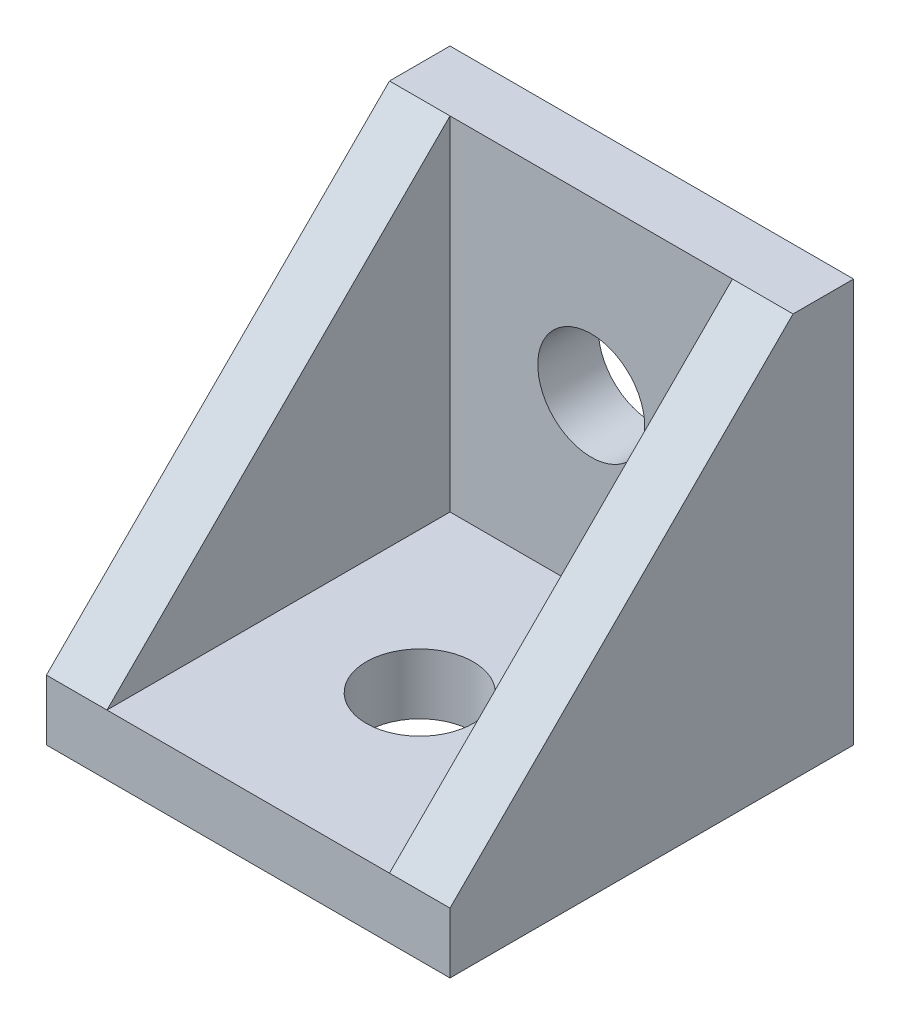
ISO-10303-21;
HEADER;
FILE_DESCRIPTION(('STEP AP214'),'2;1');
FILE_NAME('part.step','',(''),(''),'','','');
FILE_SCHEMA(('AUTOMOTIVE_DESIGN { 1 0 10303 214 1 1 1 1 }'));
ENDSEC;
DATA;
#1=APPLICATION_CONTEXT('core data for automotive mechanical design processes');
#2=APPLICATION_PROTOCOL_DEFINITION('international standard','automotive_design',2000,#1);
#3=PRODUCT_CONTEXT('',#1,'mechanical');
#4=PRODUCT('Part','Part','',(#3));
#5=PRODUCT_RELATED_PRODUCT_CATEGORY('part','',(#4));
#6=PRODUCT_DEFINITION_FORMATION('','',#4);
#7=PRODUCT_DEFINITION_CONTEXT('part definition',#1,'design');
#8=PRODUCT_DEFINITION('design','',#6,#7);
#9=PRODUCT_DEFINITION_SHAPE('','',#8);
#10=(LENGTH_UNIT() NAMED_UNIT(*) SI_UNIT(.MILLI.,.METRE.));
#11=(NAMED_UNIT(*) PLANE_ANGLE_UNIT() SI_UNIT($,.RADIAN.));
#12=(NAMED_UNIT(*) SI_UNIT($,.STERADIAN.) SOLID_ANGLE_UNIT());
#13=UNCERTAINTY_MEASURE_WITH_UNIT(LENGTH_MEASURE(1.E-05),#10,'distance_accuracy_value','');
#14=(GEOMETRIC_REPRESENTATION_CONTEXT(3) GLOBAL_UNCERTAINTY_ASSIGNED_CONTEXT((#13)) GLOBAL_UNIT_ASSIGNED_CONTEXT((#10,
#11,#12)) REPRESENTATION_CONTEXT('',''));
#15=CARTESIAN_POINT('',(0.,0.,0.));
#16=DIRECTION('',(0.,0.,1.));
#17=DIRECTION('',(1.,0.,0.));
#18=AXIS2_PLACEMENT_3D('',#15,#16,#17);
#19=CARTESIAN_POINT('',(0.,0.,20.));
#20=DIRECTION('',(0.,1.,0.));
#21=DIRECTION('',(0.,0.,1.));
#22=AXIS2_PLACEMENT_3D('',#19,#20,#21);
#23=PLANE('',#22);
#24=CARTESIAN_POINT('',(10.,0.,11.5));
#25=DIRECTION('',(0.,1.,0.));
#26=DIRECTION('',(0.,0.,1.));
#27=AXIS2_PLACEMENT_3D('',#24,#25,#26);
#28=CIRCLE('',#27,2.65);
#29=CARTESIAN_POINT('',(10.,0.,14.15));
#30=VERTEX_POINT('',#29);
#31=EDGE_CURVE('E366',#30,#30,#28,.T.);
#32=ORIENTED_EDGE('',*,*,#31,.T.);
#33=EDGE_LOOP('',(#32));
#34=FACE_BOUND('',#33,.T.);
#35=DIRECTION('',(0.,0.,1.));
#36=VECTOR('',#35,1.);
#37=CARTESIAN_POINT('',(13.,0.,0.));
#38=LINE('',#37,#36);
#39=CARTESIAN_POINT('',(13.,0.,0.));
#40=VERTEX_POINT('',#39);
#41=CARTESIAN_POINT('',(13.,0.,6.));
#42=VERTEX_POINT('',#41);
#43=EDGE_CURVE('E165',#40,#42,#38,.T.);
#44=ORIENTED_EDGE('',*,*,#43,.F.);
#45=DIRECTION('',(1.,0.,0.));
#46=VECTOR('',#45,1.);
#47=CARTESIAN_POINT('',(0.,0.,0.));
#48=LINE('',#47,#46);
#49=CARTESIAN_POINT('',(20.,0.,0.));
#50=VERTEX_POINT('',#49);
#51=EDGE_CURVE('E243',#40,#50,#48,.T.);
#52=ORIENTED_EDGE('',*,*,#51,.T.);
#53=DIRECTION('',(0.,0.,-1.));
#54=VECTOR('',#53,1.);
#55=CARTESIAN_POINT('',(20.,0.,20.));
#56=LINE('',#55,#54);
#57=CARTESIAN_POINT('',(20.,0.,20.));
#58=VERTEX_POINT('',#57);
#59=EDGE_CURVE('E255',#58,#50,#56,.T.);
#60=ORIENTED_EDGE('',*,*,#59,.F.);
#61=DIRECTION('',(1.,0.,0.));
#62=VECTOR('',#61,1.);
#63=CARTESIAN_POINT('',(0.,0.,20.));
#64=LINE('',#63,#62);
#65=CARTESIAN_POINT('',(0.,0.,20.));
#66=VERTEX_POINT('',#65);
#67=EDGE_CURVE('E234',#66,#58,#64,.T.);
#68=ORIENTED_EDGE('',*,*,#67,.F.);
#69=DIRECTION('',(0.,0.,-1.));
#70=VECTOR('',#69,1.);
#71=CARTESIAN_POINT('',(0.,0.,20.));
#72=LINE('',#71,#70);
#73=CARTESIAN_POINT('',(0.,0.,0.));
#74=VERTEX_POINT('',#73);
#75=EDGE_CURVE('E258',#66,#74,#72,.T.);
#76=ORIENTED_EDGE('',*,*,#75,.T.);
#77=CARTESIAN_POINT('',(7.,0.,0.));
#78=VERTEX_POINT('',#77);
#79=EDGE_CURVE('E244',#74,#78,#48,.T.);
#80=ORIENTED_EDGE('',*,*,#79,.T.);
#81=DIRECTION('',(0.,0.,-1.));
#82=VECTOR('',#81,1.);
#83=CARTESIAN_POINT('',(7.,0.,0.));
#84=LINE('',#83,#82);
#85=CARTESIAN_POINT('',(7.,0.,6.));
#86=VERTEX_POINT('',#85);
#87=EDGE_CURVE('E350',#86,#78,#84,.T.);
#88=ORIENTED_EDGE('',*,*,#87,.F.);
#89=DIRECTION('',(-1.,0.,0.));
#90=VECTOR('',#89,1.);
#91=CARTESIAN_POINT('',(13.,0.,6.));
#92=LINE('',#91,#90);
#93=EDGE_CURVE('E50',#42,#86,#92,.T.);
#94=ORIENTED_EDGE('',*,*,#93,.F.);
#95=EDGE_LOOP('',(#44,#52,#60,#68,#76,#80,#88,#94));
#96=FACE_BOUND('',#95,.T.);
#97=ADVANCED_FACE('F35',(#34,#96),#23,.F.);
#98=DIRECTION('',(1.,0.,0.));
#99=VECTOR('',#98,1.);
#100=CARTESIAN_POINT('',(13.,0.,0.));
#101=LINE('',#100,#99);
#102=EDGE_CURVE('E162',#78,#40,#101,.T.);
#103=ORIENTED_EDGE('',*,*,#102,.F.);
#104=DIRECTION('',(0.,0.,1.));
#105=VECTOR('',#104,1.);
#106=CARTESIAN_POINT('',(7.,0.,-2.));
#107=LINE('',#106,#105);
#108=CARTESIAN_POINT('',(7.,0.,-2.));
#109=VERTEX_POINT('',#108);
#110=EDGE_CURVE('E192',#109,#78,#107,.T.);
#111=ORIENTED_EDGE('',*,*,#110,.F.);
#112=DIRECTION('',(-1.,0.,0.));
#113=VECTOR('',#112,1.);
#114=CARTESIAN_POINT('',(13.,0.,-2.));
#115=LINE('',#114,#113);
#116=CARTESIAN_POINT('',(13.,0.,-2.));
#117=VERTEX_POINT('',#116);
#118=EDGE_CURVE('E176',#117,#109,#115,.T.);
#119=ORIENTED_EDGE('',*,*,#118,.F.);
#120=DIRECTION('',(0.,0.,1.));
#121=VECTOR('',#120,1.);
#122=CARTESIAN_POINT('',(13.,0.,-2.));
#123=LINE('',#122,#121);
#124=EDGE_CURVE('E195',#117,#40,#123,.T.);
#125=ORIENTED_EDGE('',*,*,#124,.T.);
#126=EDGE_LOOP('',(#103,#111,#119,#125));
#127=FACE_BOUND('',#126,.T.);
#128=ADVANCED_FACE('F307',(#127),#23,.F.);
#129=CARTESIAN_POINT('',(0.,20.,3.));
#130=DIRECTION('',(0.,-0.707106781186548,-0.707106781186548));
#131=DIRECTION('',(0.,0.707106781186548,-0.707106781186548));
#132=AXIS2_PLACEMENT_3D('',#129,#130,#131);
#133=PLANE('',#132);
#134=DIRECTION('',(1.,0.,0.));
#135=VECTOR('',#134,1.);
#136=CARTESIAN_POINT('',(0.,3.,20.));
#137=LINE('',#136,#135);
#138=CARTESIAN_POINT('',(0.,3.,20.));
#139=VERTEX_POINT('',#138);
#140=CARTESIAN_POINT('',(3.,3.,20.));
#141=VERTEX_POINT('',#140);
#142=EDGE_CURVE('E229',#139,#141,#137,.T.);
#143=ORIENTED_EDGE('',*,*,#142,.T.);
#144=DIRECTION('',(0.,0.707106781186548,-0.707106781186548));
#145=VECTOR('',#144,1.);
#146=CARTESIAN_POINT('',(3.,20.,3.));
#147=LINE('',#146,#145);
#148=CARTESIAN_POINT('',(3.,20.,3.));
#149=VERTEX_POINT('',#148);
#150=EDGE_CURVE('E11',#141,#149,#147,.T.);
#151=ORIENTED_EDGE('',*,*,#150,.T.);
#152=DIRECTION('',(1.,0.,0.));
#153=VECTOR('',#152,1.);
#154=CARTESIAN_POINT('',(0.,20.,3.));
#155=LINE('',#154,#153);
#156=CARTESIAN_POINT('',(0.,20.,3.));
#157=VERTEX_POINT('',#156);
#158=EDGE_CURVE('E224',#157,#149,#155,.T.);
#159=ORIENTED_EDGE('',*,*,#158,.F.);
#160=DIRECTION('',(0.,0.707106781186547,-0.707106781186547));
#161=VECTOR('',#160,1.);
#162=CARTESIAN_POINT('',(0.,20.,3.));
#163=LINE('',#162,#161);
#164=EDGE_CURVE('E218',#139,#157,#163,.T.);
#165=ORIENTED_EDGE('',*,*,#164,.F.);
#166=EDGE_LOOP('',(#143,#151,#159,#165));
#167=FACE_BOUND('',#166,.T.);
#168=ADVANCED_FACE('F289',(#167),#133,.F.);
#169=CARTESIAN_POINT('',(0.,0.,20.));
#170=DIRECTION('',(1.,0.,0.));
#171=DIRECTION('',(0.,0.,-1.));
#172=AXIS2_PLACEMENT_3D('',#169,#170,#171);
#173=PLANE('',#172);
#174=DIRECTION('',(0.,-1.,0.));
#175=VECTOR('',#174,1.);
#176=CARTESIAN_POINT('',(0.,0.,20.));
#177=LINE('',#176,#175);
#178=EDGE_CURVE('E232',#139,#66,#177,.T.);
#179=ORIENTED_EDGE('',*,*,#178,.F.);
#180=ORIENTED_EDGE('',*,*,#164,.T.);
#181=DIRECTION('',(0.,0.,-1.));
#182=VECTOR('',#181,1.);
#183=CARTESIAN_POINT('',(0.,20.,20.));
#184=LINE('',#183,#182);
#185=CARTESIAN_POINT('',(0.,20.,0.));
#186=VERTEX_POINT('',#185);
#187=EDGE_CURVE('E240',#157,#186,#184,.T.);
#188=ORIENTED_EDGE('',*,*,#187,.T.);
#189=DIRECTION('',(0.,-1.,0.));
#190=VECTOR('',#189,1.);
#191=CARTESIAN_POINT('',(0.,0.,0.));
#192=LINE('',#191,#190);
#193=EDGE_CURVE('E227',#186,#74,#192,.T.);
#194=ORIENTED_EDGE('',*,*,#193,.T.);
#195=ORIENTED_EDGE('',*,*,#75,.F.);
#196=EDGE_LOOP('',(#179,#180,#188,#194,#195));
#197=FACE_BOUND('',#196,.T.);
#198=ADVANCED_FACE('F37',(#197),#173,.F.);
#199=CARTESIAN_POINT('',(20.,0.,20.));
#200=DIRECTION('',(-1.,0.,0.));
#201=DIRECTION('',(0.,0.,1.));
#202=AXIS2_PLACEMENT_3D('',#199,#200,#201);
#203=PLANE('',#202);
#204=DIRECTION('',(0.,0.,-1.));
#205=VECTOR('',#204,1.);
#206=CARTESIAN_POINT('',(20.,20.,20.));
#207=LINE('',#206,#205);
#208=CARTESIAN_POINT('',(20.,20.,3.));
#209=VERTEX_POINT('',#208);
#210=CARTESIAN_POINT('',(20.,20.,0.));
#211=VERTEX_POINT('',#210);
#212=EDGE_CURVE('E253',#209,#211,#207,.T.);
#213=ORIENTED_EDGE('',*,*,#212,.F.);
#214=DIRECTION('',(0.,0.707106781186547,-0.707106781186547));
#215=VECTOR('',#214,1.);
#216=CARTESIAN_POINT('',(20.,20.,3.));
#217=LINE('',#216,#215);
#218=CARTESIAN_POINT('',(20.,3.,20.));
#219=VERTEX_POINT('',#218);
#220=EDGE_CURVE('E216',#219,#209,#217,.T.);
#221=ORIENTED_EDGE('',*,*,#220,.F.);
#222=DIRECTION('',(0.,1.,0.));
#223=VECTOR('',#222,1.);
#224=CARTESIAN_POINT('',(20.,0.,20.));
#225=LINE('',#224,#223);
#226=EDGE_CURVE('E237',#58,#219,#225,.T.);
#227=ORIENTED_EDGE('',*,*,#226,.F.);
#228=ORIENTED_EDGE('',*,*,#59,.T.);
#229=DIRECTION('',(0.,1.,0.));
#230=VECTOR('',#229,1.);
#231=CARTESIAN_POINT('',(20.,0.,0.));
#232=LINE('',#231,#230);
#233=EDGE_CURVE('E247',#50,#211,#232,.T.);
#234=ORIENTED_EDGE('',*,*,#233,.T.);
#235=EDGE_LOOP('',(#213,#221,#227,#228,#234));
#236=FACE_BOUND('',#235,.T.);
#237=ADVANCED_FACE('F278',(#236),#203,.F.);
#238=CARTESIAN_POINT('',(0.,20.,20.));
#239=DIRECTION('',(0.,-1.,0.));
#240=DIRECTION('',(1.,0.,0.));
#241=AXIS2_PLACEMENT_3D('',#238,#239,#240);
#242=PLANE('',#241);
#243=ORIENTED_EDGE('',*,*,#187,.F.);
#244=ORIENTED_EDGE('',*,*,#158,.T.);
#245=DIRECTION('',(-1.,0.,0.));
#246=VECTOR('',#245,1.);
#247=CARTESIAN_POINT('',(3.,20.,3.));
#248=LINE('',#247,#246);
#249=CARTESIAN_POINT('',(17.,20.,3.));
#250=VERTEX_POINT('',#249);
#251=EDGE_CURVE('E208',#250,#149,#248,.T.);
#252=ORIENTED_EDGE('',*,*,#251,.F.);
#253=EDGE_CURVE('E228',#250,#209,#155,.T.);
#254=ORIENTED_EDGE('',*,*,#253,.T.);
#255=ORIENTED_EDGE('',*,*,#212,.T.);
#256=DIRECTION('',(-1.,0.,0.));
#257=VECTOR('',#256,1.);
#258=CARTESIAN_POINT('',(0.,20.,0.));
#259=LINE('',#258,#257);
#260=EDGE_CURVE('E235',#211,#186,#259,.T.);
#261=ORIENTED_EDGE('',*,*,#260,.T.);
#262=EDGE_LOOP('',(#243,#244,#252,#254,#255,#261));
#263=FACE_BOUND('',#262,.T.);
#264=ADVANCED_FACE('F283',(#263),#242,.F.);
#265=CARTESIAN_POINT('',(0.,0.,20.));
#266=DIRECTION('',(0.,0.,-1.));
#267=DIRECTION('',(-1.,0.,0.));
#268=AXIS2_PLACEMENT_3D('',#265,#266,#267);
#269=PLANE('',#268);
#270=ORIENTED_EDGE('',*,*,#226,.T.);
#271=CARTESIAN_POINT('',(17.,3.,20.));
#272=VERTEX_POINT('',#271);
#273=EDGE_CURVE('E221',#272,#219,#137,.T.);
#274=ORIENTED_EDGE('',*,*,#273,.F.);
#275=DIRECTION('',(1.,0.,0.));
#276=VECTOR('',#275,1.);
#277=CARTESIAN_POINT('',(3.,3.,20.));
#278=LINE('',#277,#276);
#279=EDGE_CURVE('E198',#141,#272,#278,.T.);
#280=ORIENTED_EDGE('',*,*,#279,.F.);
#281=ORIENTED_EDGE('',*,*,#142,.F.);
#282=ORIENTED_EDGE('',*,*,#178,.T.);
#283=ORIENTED_EDGE('',*,*,#67,.T.);
#284=EDGE_LOOP('',(#270,#274,#280,#281,#282,#283));
#285=FACE_BOUND('',#284,.T.);
#286=ADVANCED_FACE('F271',(#285),#269,.F.);
#287=CARTESIAN_POINT('',(0.,0.,0.));
#288=DIRECTION('',(0.,0.,-1.));
#289=DIRECTION('',(-1.,0.,0.));
#290=AXIS2_PLACEMENT_3D('',#287,#288,#289);
#291=PLANE('',#290);
#292=CARTESIAN_POINT('',(10.,11.5,0.));
#293=DIRECTION('',(0.,0.,-1.));
#294=DIRECTION('',(-1.,0.,0.));
#295=AXIS2_PLACEMENT_3D('',#292,#293,#294);
#296=CIRCLE('',#295,2.65);
#297=CARTESIAN_POINT('',(7.35,11.5,0.));
#298=VERTEX_POINT('',#297);
#299=EDGE_CURVE('E358',#298,#298,#296,.T.);
#300=ORIENTED_EDGE('',*,*,#299,.F.);
#301=EDGE_LOOP('',(#300));
#302=FACE_BOUND('',#301,.T.);
#303=DIRECTION('',(0.,-1.,0.));
#304=VECTOR('',#303,1.);
#305=CARTESIAN_POINT('',(13.,0.,0.));
#306=LINE('',#305,#304);
#307=CARTESIAN_POINT('',(13.,6.,0.));
#308=VERTEX_POINT('',#307);
#309=EDGE_CURVE('E58',#308,#40,#306,.T.);
#310=ORIENTED_EDGE('',*,*,#309,.F.);
#311=DIRECTION('',(1.,0.,0.));
#312=VECTOR('',#311,1.);
#313=CARTESIAN_POINT('',(13.,6.,0.));
#314=LINE('',#313,#312);
#315=CARTESIAN_POINT('',(7.,6.,0.));
#316=VERTEX_POINT('',#315);
#317=EDGE_CURVE('E177',#316,#308,#314,.T.);
#318=ORIENTED_EDGE('',*,*,#317,.F.);
#319=DIRECTION('',(0.,1.,0.));
#320=VECTOR('',#319,1.);
#321=CARTESIAN_POINT('',(7.,0.,0.));
#322=LINE('',#321,#320);
#323=EDGE_CURVE('E167',#78,#316,#322,.T.);
#324=ORIENTED_EDGE('',*,*,#323,.F.);
#325=ORIENTED_EDGE('',*,*,#79,.F.);
#326=ORIENTED_EDGE('',*,*,#193,.F.);
#327=ORIENTED_EDGE('',*,*,#260,.F.);
#328=ORIENTED_EDGE('',*,*,#233,.F.);
#329=ORIENTED_EDGE('',*,*,#51,.F.);
#330=EDGE_LOOP('',(#310,#318,#324,#325,#326,#327,#328,#329));
#331=FACE_BOUND('',#330,.T.);
#332=ADVANCED_FACE('F319',(#302,#331),#291,.T.);
#333=ORIENTED_EDGE('',*,*,#253,.F.);
#334=DIRECTION('',(0.,-0.707106781186548,0.707106781186548));
#335=VECTOR('',#334,1.);
#336=CARTESIAN_POINT('',(17.,20.,3.));
#337=LINE('',#336,#335);
#338=EDGE_CURVE('E43',#250,#272,#337,.T.);
#339=ORIENTED_EDGE('',*,*,#338,.T.);
#340=ORIENTED_EDGE('',*,*,#273,.T.);
#341=ORIENTED_EDGE('',*,*,#220,.T.);
#342=EDGE_LOOP('',(#333,#339,#340,#341));
#343=FACE_BOUND('',#342,.T.);
#344=ADVANCED_FACE('F264',(#343),#133,.F.);
#345=CARTESIAN_POINT('',(3.,3.,3.));
#346=DIRECTION('',(-1.,0.,0.));
#347=DIRECTION('',(0.,0.,1.));
#348=AXIS2_PLACEMENT_3D('',#345,#346,#347);
#349=PLANE('',#348);
#350=DIRECTION('',(0.,0.,1.));
#351=VECTOR('',#350,1.);
#352=CARTESIAN_POINT('',(3.,3.,3.));
#353=LINE('',#352,#351);
#354=CARTESIAN_POINT('',(3.,3.,3.));
#355=VERTEX_POINT('',#354);
#356=EDGE_CURVE('E211',#355,#141,#353,.T.);
#357=ORIENTED_EDGE('',*,*,#356,.F.);
#358=DIRECTION('',(0.,-1.,0.));
#359=VECTOR('',#358,1.);
#360=CARTESIAN_POINT('',(3.,3.,3.));
#361=LINE('',#360,#359);
#362=EDGE_CURVE('E199',#149,#355,#361,.T.);
#363=ORIENTED_EDGE('',*,*,#362,.F.);
#364=ORIENTED_EDGE('',*,*,#150,.F.);
#365=EDGE_LOOP('',(#357,#363,#364));
#366=FACE_BOUND('',#365,.T.);
#367=ADVANCED_FACE('F291',(#366),#349,.F.);
#368=CARTESIAN_POINT('',(17.,3.,3.));
#369=DIRECTION('',(1.,0.,0.));
#370=DIRECTION('',(0.,0.,-1.));
#371=AXIS2_PLACEMENT_3D('',#368,#369,#370);
#372=PLANE('',#371);
#373=DIRECTION('',(0.,1.,0.));
#374=VECTOR('',#373,1.);
#375=CARTESIAN_POINT('',(17.,3.,3.));
#376=LINE('',#375,#374);
#377=CARTESIAN_POINT('',(17.,3.,3.));
#378=VERTEX_POINT('',#377);
#379=EDGE_CURVE('E205',#378,#250,#376,.T.);
#380=ORIENTED_EDGE('',*,*,#379,.F.);
#381=DIRECTION('',(0.,0.,1.));
#382=VECTOR('',#381,1.);
#383=CARTESIAN_POINT('',(17.,3.,3.));
#384=LINE('',#383,#382);
#385=EDGE_CURVE('E214',#378,#272,#384,.T.);
#386=ORIENTED_EDGE('',*,*,#385,.T.);
#387=ORIENTED_EDGE('',*,*,#338,.F.);
#388=EDGE_LOOP('',(#380,#386,#387));
#389=FACE_BOUND('',#388,.T.);
#390=ADVANCED_FACE('F295',(#389),#372,.F.);
#391=CARTESIAN_POINT('',(3.,3.,3.));
#392=DIRECTION('',(0.,-1.,0.));
#393=DIRECTION('',(0.,0.,-1.));
#394=AXIS2_PLACEMENT_3D('',#391,#392,#393);
#395=PLANE('',#394);
#396=CARTESIAN_POINT('',(10.,3.,11.5));
#397=DIRECTION('',(0.,1.,0.));
#398=DIRECTION('',(0.,0.,1.));
#399=AXIS2_PLACEMENT_3D('',#396,#397,#398);
#400=CIRCLE('',#399,2.65);
#401=CARTESIAN_POINT('',(10.,3.,14.15));
#402=VERTEX_POINT('',#401);
#403=EDGE_CURVE('E368',#402,#402,#400,.T.);
#404=ORIENTED_EDGE('',*,*,#403,.F.);
#405=EDGE_LOOP('',(#404));
#406=FACE_BOUND('',#405,.T.);
#407=ORIENTED_EDGE('',*,*,#279,.T.);
#408=ORIENTED_EDGE('',*,*,#385,.F.);
#409=DIRECTION('',(1.,0.,0.));
#410=VECTOR('',#409,1.);
#411=CARTESIAN_POINT('',(3.,3.,3.));
#412=LINE('',#411,#410);
#413=EDGE_CURVE('E202',#355,#378,#412,.T.);
#414=ORIENTED_EDGE('',*,*,#413,.F.);
#415=ORIENTED_EDGE('',*,*,#356,.T.);
#416=EDGE_LOOP('',(#407,#408,#414,#415));
#417=FACE_BOUND('',#416,.T.);
#418=ADVANCED_FACE('F294',(#406,#417),#395,.F.);
#419=CARTESIAN_POINT('',(0.,0.,3.));
#420=DIRECTION('',(0.,0.,-1.));
#421=DIRECTION('',(-1.,0.,0.));
#422=AXIS2_PLACEMENT_3D('',#419,#420,#421);
#423=PLANE('',#422);
#424=CARTESIAN_POINT('',(10.,11.5,3.));
#425=DIRECTION('',(0.,0.,1.));
#426=DIRECTION('',(1.,0.,0.));
#427=AXIS2_PLACEMENT_3D('',#424,#425,#426);
#428=CIRCLE('',#427,2.65);
#429=CARTESIAN_POINT('',(12.65,11.5,3.));
#430=VERTEX_POINT('',#429);
#431=EDGE_CURVE('E363',#430,#430,#428,.T.);
#432=ORIENTED_EDGE('',*,*,#431,.F.);
#433=EDGE_LOOP('',(#432));
#434=FACE_BOUND('',#433,.T.);
#435=ORIENTED_EDGE('',*,*,#362,.T.);
#436=ORIENTED_EDGE('',*,*,#413,.T.);
#437=ORIENTED_EDGE('',*,*,#379,.T.);
#438=ORIENTED_EDGE('',*,*,#251,.T.);
#439=EDGE_LOOP('',(#435,#436,#437,#438));
#440=FACE_BOUND('',#439,.T.);
#441=ADVANCED_FACE('F286',(#434,#440),#423,.F.);
#442=CARTESIAN_POINT('',(13.,0.,-2.));
#443=DIRECTION('',(-1.,0.,0.));
#444=DIRECTION('',(0.,0.,1.));
#445=AXIS2_PLACEMENT_3D('',#442,#443,#444);
#446=PLANE('',#445);
#447=ORIENTED_EDGE('',*,*,#309,.T.);
#448=ORIENTED_EDGE('',*,*,#124,.F.);
#449=DIRECTION('',(0.,-1.,0.));
#450=VECTOR('',#449,1.);
#451=CARTESIAN_POINT('',(13.,0.,-2.));
#452=LINE('',#451,#450);
#453=CARTESIAN_POINT('',(13.,6.,-2.));
#454=VERTEX_POINT('',#453);
#455=EDGE_CURVE('E173',#454,#117,#452,.T.);
#456=ORIENTED_EDGE('',*,*,#455,.F.);
#457=DIRECTION('',(0.,0.,1.));
#458=VECTOR('',#457,1.);
#459=CARTESIAN_POINT('',(13.,6.,-2.));
#460=LINE('',#459,#458);
#461=EDGE_CURVE('E182',#454,#308,#460,.T.);
#462=ORIENTED_EDGE('',*,*,#461,.T.);
#463=EDGE_LOOP('',(#447,#448,#456,#462));
#464=FACE_BOUND('',#463,.T.);
#465=ADVANCED_FACE('F343',(#464),#446,.F.);
#466=CARTESIAN_POINT('',(7.,0.,-2.));
#467=DIRECTION('',(1.,0.,0.));
#468=DIRECTION('',(0.,0.,-1.));
#469=AXIS2_PLACEMENT_3D('',#466,#467,#468);
#470=PLANE('',#469);
#471=ORIENTED_EDGE('',*,*,#323,.T.);
#472=DIRECTION('',(0.,0.,1.));
#473=VECTOR('',#472,1.);
#474=CARTESIAN_POINT('',(7.,6.,-2.));
#475=LINE('',#474,#473);
#476=CARTESIAN_POINT('',(7.,6.,-2.));
#477=VERTEX_POINT('',#476);
#478=EDGE_CURVE('E189',#477,#316,#475,.T.);
#479=ORIENTED_EDGE('',*,*,#478,.F.);
#480=DIRECTION('',(0.,1.,0.));
#481=VECTOR('',#480,1.);
#482=CARTESIAN_POINT('',(7.,0.,-2.));
#483=LINE('',#482,#481);
#484=EDGE_CURVE('E179',#109,#477,#483,.T.);
#485=ORIENTED_EDGE('',*,*,#484,.F.);
#486=ORIENTED_EDGE('',*,*,#110,.T.);
#487=EDGE_LOOP('',(#471,#479,#485,#486));
#488=FACE_BOUND('',#487,.T.);
#489=ADVANCED_FACE('F403',(#488),#470,.F.);
#490=CARTESIAN_POINT('',(13.,6.,-2.));
#491=DIRECTION('',(0.,-1.,0.));
#492=DIRECTION('',(0.,0.,-1.));
#493=AXIS2_PLACEMENT_3D('',#490,#491,#492);
#494=PLANE('',#493);
#495=ORIENTED_EDGE('',*,*,#317,.T.);
#496=ORIENTED_EDGE('',*,*,#461,.F.);
#497=DIRECTION('',(1.,0.,0.));
#498=VECTOR('',#497,1.);
#499=CARTESIAN_POINT('',(13.,6.,-2.));
#500=LINE('',#499,#498);
#501=EDGE_CURVE('E181',#477,#454,#500,.T.);
#502=ORIENTED_EDGE('',*,*,#501,.F.);
#503=ORIENTED_EDGE('',*,*,#478,.T.);
#504=EDGE_LOOP('',(#495,#496,#502,#503));
#505=FACE_BOUND('',#504,.T.);
#506=ADVANCED_FACE('F399',(#505),#494,.F.);
#507=CARTESIAN_POINT('',(0.,0.,-2.));
#508=DIRECTION('',(0.,0.,1.));
#509=DIRECTION('',(1.,0.,0.));
#510=AXIS2_PLACEMENT_3D('',#507,#508,#509);
#511=PLANE('',#510);
#512=ORIENTED_EDGE('',*,*,#455,.T.);
#513=ORIENTED_EDGE('',*,*,#118,.T.);
#514=ORIENTED_EDGE('',*,*,#484,.T.);
#515=ORIENTED_EDGE('',*,*,#501,.T.);
#516=EDGE_LOOP('',(#512,#513,#514,#515));
#517=FACE_BOUND('',#516,.T.);
#518=ADVANCED_FACE('F396',(#517),#511,.F.);
#519=CARTESIAN_POINT('',(13.,-2.,0.));
#520=DIRECTION('',(-1.,0.,0.));
#521=DIRECTION('',(0.,0.,1.));
#522=AXIS2_PLACEMENT_3D('',#519,#520,#521);
#523=PLANE('',#522);
#524=ORIENTED_EDGE('',*,*,#43,.T.);
#525=DIRECTION('',(0.,1.,0.));
#526=VECTOR('',#525,1.);
#527=CARTESIAN_POINT('',(13.,-2.,6.));
#528=LINE('',#527,#526);
#529=CARTESIAN_POINT('',(13.,-2.,6.));
#530=VERTEX_POINT('',#529);
#531=EDGE_CURVE('E146',#530,#42,#528,.T.);
#532=ORIENTED_EDGE('',*,*,#531,.F.);
#533=DIRECTION('',(0.,0.,1.));
#534=VECTOR('',#533,1.);
#535=CARTESIAN_POINT('',(13.,-2.,0.));
#536=LINE('',#535,#534);
#537=CARTESIAN_POINT('',(13.,-2.,0.));
#538=VERTEX_POINT('',#537);
#539=EDGE_CURVE('E153',#538,#530,#536,.T.);
#540=ORIENTED_EDGE('',*,*,#539,.F.);
#541=DIRECTION('',(0.,1.,0.));
#542=VECTOR('',#541,1.);
#543=CARTESIAN_POINT('',(13.,-2.,0.));
#544=LINE('',#543,#542);
#545=EDGE_CURVE('E348',#538,#40,#544,.T.);
#546=ORIENTED_EDGE('',*,*,#545,.T.);
#547=EDGE_LOOP('',(#524,#532,#540,#546));
#548=FACE_BOUND('',#547,.T.);
#549=ADVANCED_FACE('F164',(#548),#523,.F.);
#550=CARTESIAN_POINT('',(13.,-2.,6.));
#551=DIRECTION('',(0.,0.,-1.));
#552=DIRECTION('',(-1.,0.,0.));
#553=AXIS2_PLACEMENT_3D('',#550,#551,#552);
#554=PLANE('',#553);
#555=ORIENTED_EDGE('',*,*,#93,.T.);
#556=DIRECTION('',(0.,1.,0.));
#557=VECTOR('',#556,1.);
#558=CARTESIAN_POINT('',(7.,-2.,6.));
#559=LINE('',#558,#557);
#560=CARTESIAN_POINT('',(7.,-2.,6.));
#561=VERTEX_POINT('',#560);
#562=EDGE_CURVE('E149',#561,#86,#559,.T.);
#563=ORIENTED_EDGE('',*,*,#562,.F.);
#564=DIRECTION('',(-1.,0.,0.));
#565=VECTOR('',#564,1.);
#566=CARTESIAN_POINT('',(13.,-2.,6.));
#567=LINE('',#566,#565);
#568=EDGE_CURVE('E142',#530,#561,#567,.T.);
#569=ORIENTED_EDGE('',*,*,#568,.F.);
#570=ORIENTED_EDGE('',*,*,#531,.T.);
#571=EDGE_LOOP('',(#555,#563,#569,#570));
#572=FACE_BOUND('',#571,.T.);
#573=ADVANCED_FACE('F144',(#572),#554,.F.);
#574=CARTESIAN_POINT('',(7.,-2.,0.));
#575=DIRECTION('',(1.,0.,0.));
#576=DIRECTION('',(0.,0.,-1.));
#577=AXIS2_PLACEMENT_3D('',#574,#575,#576);
#578=PLANE('',#577);
#579=ORIENTED_EDGE('',*,*,#87,.T.);
#580=DIRECTION('',(0.,1.,0.));
#581=VECTOR('',#580,1.);
#582=CARTESIAN_POINT('',(7.,-2.,0.));
#583=LINE('',#582,#581);
#584=CARTESIAN_POINT('',(7.,-2.,0.));
#585=VERTEX_POINT('',#584);
#586=EDGE_CURVE('E169',#585,#78,#583,.T.);
#587=ORIENTED_EDGE('',*,*,#586,.F.);
#588=DIRECTION('',(0.,0.,-1.));
#589=VECTOR('',#588,1.);
#590=CARTESIAN_POINT('',(7.,-2.,0.));
#591=LINE('',#590,#589);
#592=EDGE_CURVE('E152',#561,#585,#591,.T.);
#593=ORIENTED_EDGE('',*,*,#592,.F.);
#594=ORIENTED_EDGE('',*,*,#562,.T.);
#595=EDGE_LOOP('',(#579,#587,#593,#594));
#596=FACE_BOUND('',#595,.T.);
#597=ADVANCED_FACE('F388',(#596),#578,.F.);
#598=CARTESIAN_POINT('',(13.,-2.,0.));
#599=DIRECTION('',(0.,0.,1.));
#600=DIRECTION('',(1.,0.,0.));
#601=AXIS2_PLACEMENT_3D('',#598,#599,#600);
#602=PLANE('',#601);
#603=ORIENTED_EDGE('',*,*,#102,.T.);
#604=ORIENTED_EDGE('',*,*,#545,.F.);
#605=DIRECTION('',(1.,0.,0.));
#606=VECTOR('',#605,1.);
#607=CARTESIAN_POINT('',(13.,-2.,0.));
#608=LINE('',#607,#606);
#609=EDGE_CURVE('E158',#585,#538,#608,.T.);
#610=ORIENTED_EDGE('',*,*,#609,.F.);
#611=ORIENTED_EDGE('',*,*,#586,.T.);
#612=EDGE_LOOP('',(#603,#604,#610,#611));
#613=FACE_BOUND('',#612,.T.);
#614=ADVANCED_FACE('F347',(#613),#602,.F.);
#615=CARTESIAN_POINT('',(0.,-2.,0.));
#616=DIRECTION('',(0.,-1.,0.));
#617=DIRECTION('',(0.,0.,-1.));
#618=AXIS2_PLACEMENT_3D('',#615,#616,#617);
#619=PLANE('',#618);
#620=ORIENTED_EDGE('',*,*,#539,.T.);
#621=ORIENTED_EDGE('',*,*,#568,.T.);
#622=ORIENTED_EDGE('',*,*,#592,.T.);
#623=ORIENTED_EDGE('',*,*,#609,.T.);
#624=EDGE_LOOP('',(#620,#621,#622,#623));
#625=FACE_BOUND('',#624,.T.);
#626=ADVANCED_FACE('F156',(#625),#619,.T.);
#627=CARTESIAN_POINT('',(10.,11.5,-2.));
#628=DIRECTION('',(0.,0.,1.));
#629=DIRECTION('',(1.,0.,0.));
#630=AXIS2_PLACEMENT_3D('',#627,#628,#629);
#631=CYLINDRICAL_SURFACE('',#630,2.65);
#632=ORIENTED_EDGE('',*,*,#299,.T.);
#633=EDGE_LOOP('',(#632));
#634=FACE_BOUND('',#633,.T.);
#635=ORIENTED_EDGE('',*,*,#431,.T.);
#636=EDGE_LOOP('',(#635));
#637=FACE_BOUND('',#636,.T.);
#638=ADVANCED_FACE('F375',(#634,#637),#631,.F.);
#639=CARTESIAN_POINT('',(10.,-2.,11.5));
#640=DIRECTION('',(0.,1.,0.));
#641=DIRECTION('',(0.,0.,1.));
#642=AXIS2_PLACEMENT_3D('',#639,#640,#641);
#643=CYLINDRICAL_SURFACE('',#642,2.65);
#644=ORIENTED_EDGE('',*,*,#403,.T.);
#645=EDGE_LOOP('',(#644));
#646=FACE_BOUND('',#645,.T.);
#647=ORIENTED_EDGE('',*,*,#31,.F.);
#648=EDGE_LOOP('',(#647));
#649=FACE_BOUND('',#648,.T.);
#650=ADVANCED_FACE('F372',(#646,#649),#643,.F.);
#651=CLOSED_SHELL('',(#97,#128,#168,#198,#237,#264,#286,#332,#344,#367,#390,#418,#441,#465,#489,
#506,#518,#549,#573,#597,#614,#626,#638,#650));
#652=MANIFOLD_SOLID_BREP('B2',#651);
#653=ADVANCED_BREP_SHAPE_REPRESENTATION('',(#18,#652),#14);
#654=SHAPE_DEFINITION_REPRESENTATION(#9,#653);
ENDSEC;
END-ISO-10303-21;
